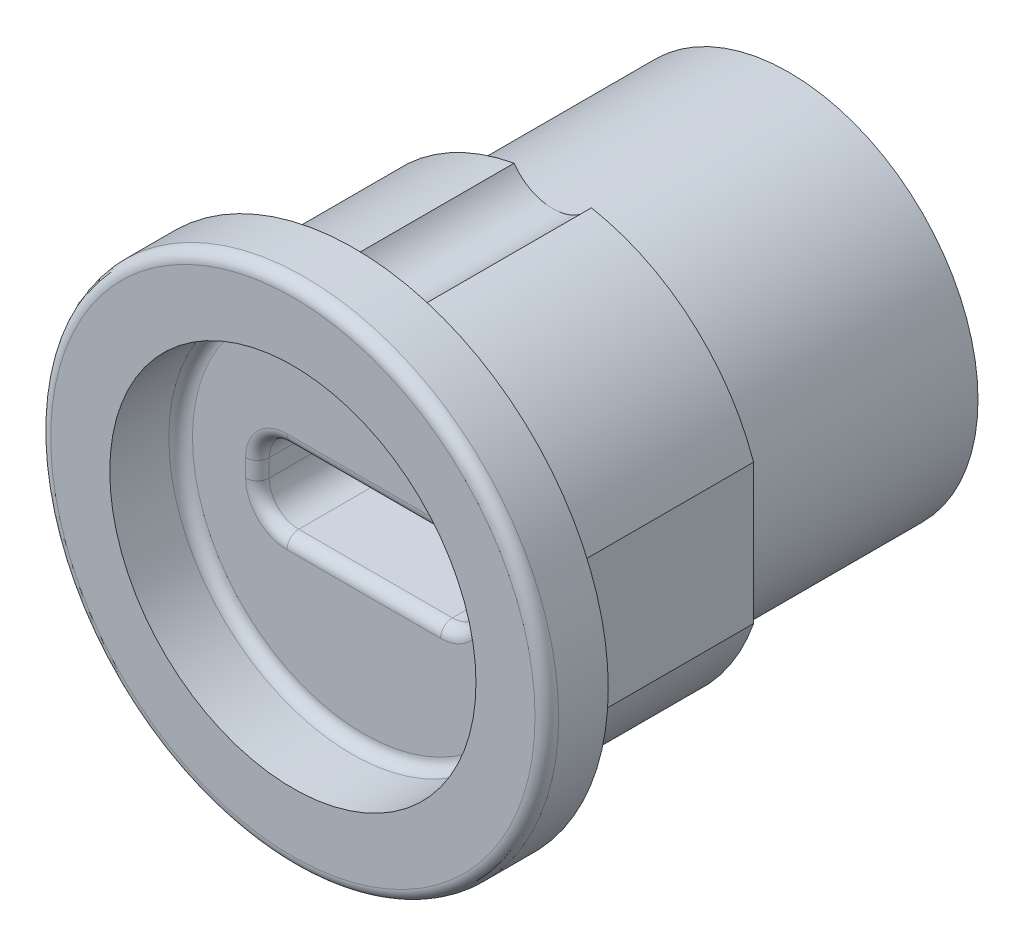
ISO-10303-21;
HEADER;
FILE_DESCRIPTION(('STEP AP214'),'2;1');
FILE_NAME('part.step','',(''),(''),'','','');
FILE_SCHEMA(('AUTOMOTIVE_DESIGN { 1 0 10303 214 1 1 1 1 }'));
ENDSEC;
DATA;
#1=APPLICATION_CONTEXT('core data for automotive mechanical design processes');
#2=APPLICATION_PROTOCOL_DEFINITION('international standard','automotive_design',2000,#1);
#3=PRODUCT_CONTEXT('',#1,'mechanical');
#4=PRODUCT('Part','Part','',(#3));
#5=PRODUCT_RELATED_PRODUCT_CATEGORY('part','',(#4));
#6=PRODUCT_DEFINITION_FORMATION('','',#4);
#7=PRODUCT_DEFINITION_CONTEXT('part definition',#1,'design');
#8=PRODUCT_DEFINITION('design','',#6,#7);
#9=PRODUCT_DEFINITION_SHAPE('','',#8);
#10=(LENGTH_UNIT() NAMED_UNIT(*) SI_UNIT(.MILLI.,.METRE.));
#11=(NAMED_UNIT(*) PLANE_ANGLE_UNIT() SI_UNIT($,.RADIAN.));
#12=(NAMED_UNIT(*) SI_UNIT($,.STERADIAN.) SOLID_ANGLE_UNIT());
#13=UNCERTAINTY_MEASURE_WITH_UNIT(LENGTH_MEASURE(1.E-05),#10,'distance_accuracy_value','');
#14=(GEOMETRIC_REPRESENTATION_CONTEXT(3) GLOBAL_UNCERTAINTY_ASSIGNED_CONTEXT((#13)) GLOBAL_UNIT_ASSIGNED_CONTEXT((#10,
#11,#12)) REPRESENTATION_CONTEXT('',''));
#15=CARTESIAN_POINT('',(0.,0.,0.));
#16=DIRECTION('',(0.,0.,1.));
#17=DIRECTION('',(1.,0.,0.));
#18=AXIS2_PLACEMENT_3D('',#15,#16,#17);
#19=CARTESIAN_POINT('',(0.,0.,-18.4));
#20=DIRECTION('',(0.,0.,1.));
#21=DIRECTION('',(1.,0.,0.));
#22=AXIS2_PLACEMENT_3D('',#19,#20,#21);
#23=CYLINDRICAL_SURFACE('',#22,9.);
#24=DIRECTION('',(0.,0.,-1.));
#25=VECTOR('',#24,1.);
#26=CARTESIAN_POINT('',(-1.63630681719536,8.85,5.93717104351895));
#27=LINE('',#26,#25);
#28=CARTESIAN_POINT('',(-1.63630681719536,8.85,0.));
#29=VERTEX_POINT('',#28);
#30=CARTESIAN_POINT('',(-1.63630681719536,8.85,-8.4));
#31=VERTEX_POINT('',#30);
#32=EDGE_CURVE('E225',#29,#31,#27,.T.);
#33=ORIENTED_EDGE('',*,*,#32,.T.);
#34=CARTESIAN_POINT('',(0.,0.,-8.4));
#35=DIRECTION('',(0.,0.,-1.));
#36=DIRECTION('',(-1.,0.,0.));
#37=AXIS2_PLACEMENT_3D('',#34,#35,#36);
#38=CIRCLE('',#37,9.);
#39=CARTESIAN_POINT('',(-8.5,2.9580398915498,-8.4));
#40=VERTEX_POINT('',#39);
#41=EDGE_CURVE('E256',#40,#31,#38,.T.);
#42=ORIENTED_EDGE('',*,*,#41,.F.);
#43=DIRECTION('',(0.,0.,-1.));
#44=VECTOR('',#43,1.);
#45=CARTESIAN_POINT('',(-8.5,2.9580398915498,5.93717104351895));
#46=LINE('',#45,#44);
#47=CARTESIAN_POINT('',(-8.5,2.9580398915498,0.));
#48=VERTEX_POINT('',#47);
#49=EDGE_CURVE('E234',#48,#40,#46,.T.);
#50=ORIENTED_EDGE('',*,*,#49,.F.);
#51=CARTESIAN_POINT('',(0.,0.,0.));
#52=DIRECTION('',(0.,0.,1.));
#53=DIRECTION('',(1.,0.,0.));
#54=AXIS2_PLACEMENT_3D('',#51,#52,#53);
#55=CIRCLE('',#54,9.);
#56=EDGE_CURVE('E271',#29,#48,#55,.T.);
#57=ORIENTED_EDGE('',*,*,#56,.F.);
#58=EDGE_LOOP('',(#33,#42,#50,#57));
#59=FACE_BOUND('',#58,.T.);
#60=ADVANCED_FACE('F33',(#59),#23,.T.);
#61=DIRECTION('',(0.,0.,-1.));
#62=VECTOR('',#61,1.);
#63=CARTESIAN_POINT('',(8.5,-2.9580398915498,5.93717104351895));
#64=LINE('',#63,#62);
#65=CARTESIAN_POINT('',(8.5,-2.95803989154981,0.));
#66=VERTEX_POINT('',#65);
#67=CARTESIAN_POINT('',(8.5,-2.9580398915498,-8.4));
#68=VERTEX_POINT('',#67);
#69=EDGE_CURVE('E240',#66,#68,#64,.T.);
#70=ORIENTED_EDGE('',*,*,#69,.F.);
#71=CARTESIAN_POINT('',(-8.5,-2.9580398915498,0.));
#72=VERTEX_POINT('',#71);
#73=EDGE_CURVE('E266',#72,#66,#55,.T.);
#74=ORIENTED_EDGE('',*,*,#73,.F.);
#75=DIRECTION('',(0.,0.,-1.));
#76=VECTOR('',#75,1.);
#77=CARTESIAN_POINT('',(-8.5,-2.9580398915498,5.93717104351895));
#78=LINE('',#77,#76);
#79=CARTESIAN_POINT('',(-8.5,-2.9580398915498,-8.4));
#80=VERTEX_POINT('',#79);
#81=EDGE_CURVE('E246',#72,#80,#78,.T.);
#82=ORIENTED_EDGE('',*,*,#81,.T.);
#83=EDGE_CURVE('E253',#68,#80,#38,.T.);
#84=ORIENTED_EDGE('',*,*,#83,.F.);
#85=EDGE_LOOP('',(#70,#74,#82,#84));
#86=FACE_BOUND('',#85,.T.);
#87=ADVANCED_FACE('F392',(#86),#23,.T.);
#88=DIRECTION('',(0.,0.,-1.));
#89=VECTOR('',#88,1.);
#90=CARTESIAN_POINT('',(1.63630681719536,8.85,5.93717104351895));
#91=LINE('',#90,#89);
#92=CARTESIAN_POINT('',(1.63630681719536,8.85,0.));
#93=VERTEX_POINT('',#92);
#94=CARTESIAN_POINT('',(1.63630681719536,8.85,-8.4));
#95=VERTEX_POINT('',#94);
#96=EDGE_CURVE('E228',#93,#95,#91,.T.);
#97=ORIENTED_EDGE('',*,*,#96,.F.);
#98=CARTESIAN_POINT('',(8.5,2.9580398915498,0.));
#99=VERTEX_POINT('',#98);
#100=EDGE_CURVE('E267',#99,#93,#55,.T.);
#101=ORIENTED_EDGE('',*,*,#100,.F.);
#102=DIRECTION('',(0.,0.,-1.));
#103=VECTOR('',#102,1.);
#104=CARTESIAN_POINT('',(8.5,2.9580398915498,5.93717104351895));
#105=LINE('',#104,#103);
#106=CARTESIAN_POINT('',(8.5,2.9580398915498,-8.4));
#107=VERTEX_POINT('',#106);
#108=EDGE_CURVE('E237',#99,#107,#105,.T.);
#109=ORIENTED_EDGE('',*,*,#108,.T.);
#110=EDGE_CURVE('E260',#95,#107,#38,.T.);
#111=ORIENTED_EDGE('',*,*,#110,.F.);
#112=EDGE_LOOP('',(#97,#101,#109,#111));
#113=FACE_BOUND('',#112,.T.);
#114=ADVANCED_FACE('F395',(#113),#23,.T.);
#115=CARTESIAN_POINT('',(0.,0.,2.6));
#116=DIRECTION('',(0.,0.,-1.));
#117=DIRECTION('',(-1.,0.,0.));
#118=AXIS2_PLACEMENT_3D('',#115,#116,#117);
#119=CYLINDRICAL_SURFACE('',#118,10.75);
#120=CARTESIAN_POINT('',(0.,0.,2.1));
#121=DIRECTION('',(0.,0.,1.));
#122=DIRECTION('',(1.,0.,0.));
#123=AXIS2_PLACEMENT_3D('',#120,#121,#122);
#124=CIRCLE('',#123,10.75);
#125=CARTESIAN_POINT('',(10.75,0.,2.1));
#126=VERTEX_POINT('',#125);
#127=EDGE_CURVE('E308',#126,#126,#124,.F.);
#128=ORIENTED_EDGE('',*,*,#127,.T.);
#129=EDGE_LOOP('',(#128));
#130=FACE_BOUND('',#129,.T.);
#131=CARTESIAN_POINT('',(0.,0.,0.));
#132=DIRECTION('',(0.,0.,1.));
#133=DIRECTION('',(1.,0.,0.));
#134=AXIS2_PLACEMENT_3D('',#131,#132,#133);
#135=CIRCLE('',#134,10.75);
#136=CARTESIAN_POINT('',(10.75,0.,0.));
#137=VERTEX_POINT('',#136);
#138=EDGE_CURVE('E263',#137,#137,#135,.T.);
#139=ORIENTED_EDGE('',*,*,#138,.T.);
#140=EDGE_LOOP('',(#139));
#141=FACE_BOUND('',#140,.T.);
#142=ADVANCED_FACE('F403',(#130,#141),#119,.T.);
#143=CARTESIAN_POINT('',(0.,0.,2.6));
#144=DIRECTION('',(0.,0.,1.));
#145=DIRECTION('',(1.,0.,0.));
#146=AXIS2_PLACEMENT_3D('',#143,#144,#145);
#147=PLANE('',#146);
#148=CARTESIAN_POINT('',(0.,0.,2.6));
#149=DIRECTION('',(0.,0.,1.));
#150=DIRECTION('',(1.,0.,0.));
#151=AXIS2_PLACEMENT_3D('',#148,#149,#150);
#152=CIRCLE('',#151,10.25);
#153=CARTESIAN_POINT('',(10.25,0.,2.6));
#154=VERTEX_POINT('',#153);
#155=EDGE_CURVE('E305',#154,#154,#152,.T.);
#156=ORIENTED_EDGE('',*,*,#155,.T.);
#157=EDGE_LOOP('',(#156));
#158=FACE_BOUND('',#157,.T.);
#159=CARTESIAN_POINT('',(0.,0.,2.6));
#160=DIRECTION('',(0.,0.,1.));
#161=DIRECTION('',(1.,0.,0.));
#162=AXIS2_PLACEMENT_3D('',#159,#160,#161);
#163=CIRCLE('',#162,7.75);
#164=CARTESIAN_POINT('',(7.75,0.,2.6));
#165=VERTEX_POINT('',#164);
#166=EDGE_CURVE('E259',#165,#165,#163,.T.);
#167=ORIENTED_EDGE('',*,*,#166,.F.);
#168=EDGE_LOOP('',(#167));
#169=FACE_BOUND('',#168,.T.);
#170=ADVANCED_FACE('F408',(#158,#169),#147,.T.);
#171=CARTESIAN_POINT('',(0.,0.,0.));
#172=DIRECTION('',(0.,0.,1.));
#173=DIRECTION('',(1.,0.,0.));
#174=AXIS2_PLACEMENT_3D('',#171,#172,#173);
#175=PLANE('',#174);
#176=ORIENTED_EDGE('',*,*,#100,.T.);
#177=CARTESIAN_POINT('',(0.,10.,0.));
#178=DIRECTION('',(0.,0.,1.));
#179=DIRECTION('',(1.,0.,0.));
#180=AXIS2_PLACEMENT_3D('',#177,#178,#179);
#181=CIRCLE('',#180,2.);
#182=EDGE_CURVE('E221',#93,#29,#181,.F.);
#183=ORIENTED_EDGE('',*,*,#182,.T.);
#184=ORIENTED_EDGE('',*,*,#56,.T.);
#185=DIRECTION('',(0.,-1.,0.));
#186=VECTOR('',#185,1.);
#187=CARTESIAN_POINT('',(-8.5,2.9580398915498,0.));
#188=LINE('',#187,#186);
#189=EDGE_CURVE('E243',#48,#72,#188,.T.);
#190=ORIENTED_EDGE('',*,*,#189,.T.);
#191=ORIENTED_EDGE('',*,*,#73,.T.);
#192=DIRECTION('',(0.,1.,0.));
#193=VECTOR('',#192,1.);
#194=CARTESIAN_POINT('',(8.5,2.9580398915498,0.));
#195=LINE('',#194,#193);
#196=EDGE_CURVE('E233',#66,#99,#195,.T.);
#197=ORIENTED_EDGE('',*,*,#196,.T.);
#198=EDGE_LOOP('',(#176,#183,#184,#190,#191,#197));
#199=FACE_BOUND('',#198,.T.);
#200=ORIENTED_EDGE('',*,*,#138,.F.);
#201=EDGE_LOOP('',(#200));
#202=FACE_BOUND('',#201,.T.);
#203=ADVANCED_FACE('F418',(#199,#202),#175,.F.);
#204=CARTESIAN_POINT('',(0.,0.,-0.4));
#205=DIRECTION('',(0.,0.,1.));
#206=DIRECTION('',(1.,0.,0.));
#207=AXIS2_PLACEMENT_3D('',#204,#205,#206);
#208=CYLINDRICAL_SURFACE('',#207,7.75);
#209=CARTESIAN_POINT('',(0.,0.,0.0999999999999998));
#210=DIRECTION('',(0.,0.,1.));
#211=DIRECTION('',(1.,0.,0.));
#212=AXIS2_PLACEMENT_3D('',#209,#210,#211);
#213=CIRCLE('',#212,7.75);
#214=CARTESIAN_POINT('',(7.75,0.,0.0999999999999998));
#215=VERTEX_POINT('',#214);
#216=EDGE_CURVE('E42',#215,#215,#213,.F.);
#217=ORIENTED_EDGE('',*,*,#216,.T.);
#218=EDGE_LOOP('',(#217));
#219=FACE_BOUND('',#218,.T.);
#220=ORIENTED_EDGE('',*,*,#166,.T.);
#221=EDGE_LOOP('',(#220));
#222=FACE_BOUND('',#221,.T.);
#223=ADVANCED_FACE('F453',(#219,#222),#208,.F.);
#224=CARTESIAN_POINT('',(0.,0.,-0.4));
#225=DIRECTION('',(0.,0.,1.));
#226=DIRECTION('',(1.,0.,0.));
#227=AXIS2_PLACEMENT_3D('',#224,#225,#226);
#228=PLANE('',#227);
#229=CARTESIAN_POINT('',(0.,0.,-0.4));
#230=DIRECTION('',(0.,0.,1.));
#231=DIRECTION('',(1.,0.,0.));
#232=AXIS2_PLACEMENT_3D('',#229,#230,#231);
#233=CIRCLE('',#232,7.25);
#234=CARTESIAN_POINT('',(7.25,0.,-0.4));
#235=VERTEX_POINT('',#234);
#236=EDGE_CURVE('E291',#235,#235,#233,.T.);
#237=ORIENTED_EDGE('',*,*,#236,.T.);
#238=EDGE_LOOP('',(#237));
#239=FACE_BOUND('',#238,.T.);
#240=DIRECTION('',(-1.,0.,0.));
#241=VECTOR('',#240,1.);
#242=CARTESIAN_POINT('',(3.25,2.125,-0.4));
#243=LINE('',#242,#241);
#244=CARTESIAN_POINT('',(-3.25,2.125,-0.4));
#245=VERTEX_POINT('',#244);
#246=CARTESIAN_POINT('',(3.25,2.125,-0.4));
#247=VERTEX_POINT('',#246);
#248=EDGE_CURVE('E274',#245,#247,#243,.F.);
#249=ORIENTED_EDGE('',*,*,#248,.T.);
#250=CARTESIAN_POINT('',(3.25,0.375,-0.4));
#251=DIRECTION('',(0.,0.,1.));
#252=DIRECTION('',(1.,0.,0.));
#253=AXIS2_PLACEMENT_3D('',#250,#251,#252);
#254=CIRCLE('',#253,1.75);
#255=CARTESIAN_POINT('',(5.,0.375,-0.4));
#256=VERTEX_POINT('',#255);
#257=EDGE_CURVE('E288',#247,#256,#254,.F.);
#258=ORIENTED_EDGE('',*,*,#257,.T.);
#259=DIRECTION('',(0.,1.,0.));
#260=VECTOR('',#259,1.);
#261=CARTESIAN_POINT('',(5.,-0.375,-0.4));
#262=LINE('',#261,#260);
#263=CARTESIAN_POINT('',(5.,-0.375,-0.4));
#264=VERTEX_POINT('',#263);
#265=EDGE_CURVE('E286',#256,#264,#262,.F.);
#266=ORIENTED_EDGE('',*,*,#265,.T.);
#267=CARTESIAN_POINT('',(3.25,-0.375,-0.4));
#268=DIRECTION('',(0.,0.,1.));
#269=DIRECTION('',(1.,0.,0.));
#270=AXIS2_PLACEMENT_3D('',#267,#268,#269);
#271=CIRCLE('',#270,1.75);
#272=CARTESIAN_POINT('',(3.25,-2.125,-0.4));
#273=VERTEX_POINT('',#272);
#274=EDGE_CURVE('E284',#264,#273,#271,.F.);
#275=ORIENTED_EDGE('',*,*,#274,.T.);
#276=DIRECTION('',(1.,0.,0.));
#277=VECTOR('',#276,1.);
#278=CARTESIAN_POINT('',(-3.25,-2.125,-0.4));
#279=LINE('',#278,#277);
#280=CARTESIAN_POINT('',(-3.25,-2.125,-0.4));
#281=VERTEX_POINT('',#280);
#282=EDGE_CURVE('E282',#273,#281,#279,.F.);
#283=ORIENTED_EDGE('',*,*,#282,.T.);
#284=CARTESIAN_POINT('',(-3.25,-0.375,-0.4));
#285=DIRECTION('',(0.,0.,1.));
#286=DIRECTION('',(1.,0.,0.));
#287=AXIS2_PLACEMENT_3D('',#284,#285,#286);
#288=CIRCLE('',#287,1.75);
#289=CARTESIAN_POINT('',(-5.,-0.375,-0.4));
#290=VERTEX_POINT('',#289);
#291=EDGE_CURVE('E280',#281,#290,#288,.F.);
#292=ORIENTED_EDGE('',*,*,#291,.T.);
#293=DIRECTION('',(0.,-1.,0.));
#294=VECTOR('',#293,1.);
#295=CARTESIAN_POINT('',(-5.,0.375,-0.4));
#296=LINE('',#295,#294);
#297=CARTESIAN_POINT('',(-5.,0.375,-0.4));
#298=VERTEX_POINT('',#297);
#299=EDGE_CURVE('E278',#290,#298,#296,.F.);
#300=ORIENTED_EDGE('',*,*,#299,.T.);
#301=CARTESIAN_POINT('',(-3.25,0.375,-0.4));
#302=DIRECTION('',(0.,0.,1.));
#303=DIRECTION('',(1.,0.,0.));
#304=AXIS2_PLACEMENT_3D('',#301,#302,#303);
#305=CIRCLE('',#304,1.75);
#306=EDGE_CURVE('E276',#298,#245,#305,.F.);
#307=ORIENTED_EDGE('',*,*,#306,.T.);
#308=EDGE_LOOP('',(#249,#258,#266,#275,#283,#292,#300,#307));
#309=FACE_BOUND('',#308,.T.);
#310=ADVANCED_FACE('F371',(#239,#309),#228,.T.);
#311=CARTESIAN_POINT('',(0.,0.,-8.4));
#312=DIRECTION('',(0.,0.,-1.));
#313=DIRECTION('',(-1.,0.,0.));
#314=AXIS2_PLACEMENT_3D('',#311,#312,#313);
#315=PLANE('',#314);
#316=CARTESIAN_POINT('',(0.,10.,-8.4));
#317=DIRECTION('',(0.,0.,-1.));
#318=DIRECTION('',(-1.,0.,0.));
#319=AXIS2_PLACEMENT_3D('',#316,#317,#318);
#320=CIRCLE('',#319,2.);
#321=CARTESIAN_POINT('',(0.,8.,-8.4));
#322=VERTEX_POINT('',#321);
#323=EDGE_CURVE('E219',#95,#322,#320,.T.);
#324=ORIENTED_EDGE('',*,*,#323,.F.);
#325=ORIENTED_EDGE('',*,*,#110,.T.);
#326=DIRECTION('',(0.,1.,0.));
#327=VECTOR('',#326,1.);
#328=CARTESIAN_POINT('',(8.5,2.9580398915498,-8.4));
#329=LINE('',#328,#327);
#330=EDGE_CURVE('E231',#68,#107,#329,.T.);
#331=ORIENTED_EDGE('',*,*,#330,.F.);
#332=ORIENTED_EDGE('',*,*,#83,.T.);
#333=DIRECTION('',(0.,-1.,0.));
#334=VECTOR('',#333,1.);
#335=CARTESIAN_POINT('',(-8.5,2.9580398915498,-8.4));
#336=LINE('',#335,#334);
#337=EDGE_CURVE('E203',#40,#80,#336,.T.);
#338=ORIENTED_EDGE('',*,*,#337,.F.);
#339=ORIENTED_EDGE('',*,*,#41,.T.);
#340=EDGE_CURVE('E222',#322,#31,#320,.T.);
#341=ORIENTED_EDGE('',*,*,#340,.F.);
#342=CARTESIAN_POINT('',(0.,0.,-8.4));
#343=DIRECTION('',(0.,0.,-1.));
#344=DIRECTION('',(-1.,0.,0.));
#345=AXIS2_PLACEMENT_3D('',#342,#343,#344);
#346=CIRCLE('',#345,8.);
#347=EDGE_CURVE('E250',#322,#322,#346,.T.);
#348=ORIENTED_EDGE('',*,*,#347,.F.);
#349=EDGE_LOOP('',(#324,#325,#331,#332,#338,#339,#341,#348));
#350=FACE_BOUND('',#349,.T.);
#351=ADVANCED_FACE('F432',(#350),#315,.T.);
#352=CARTESIAN_POINT('',(0.,0.,-8.4));
#353=DIRECTION('',(0.,0.,-1.));
#354=DIRECTION('',(-1.,0.,0.));
#355=AXIS2_PLACEMENT_3D('',#352,#353,#354);
#356=CYLINDRICAL_SURFACE('',#355,8.);
#357=ORIENTED_EDGE('',*,*,#347,.T.);
#358=EDGE_LOOP('',(#357));
#359=FACE_BOUND('',#358,.T.);
#360=CARTESIAN_POINT('',(0.,0.,-18.4));
#361=DIRECTION('',(0.,0.,-1.));
#362=DIRECTION('',(-1.,0.,0.));
#363=AXIS2_PLACEMENT_3D('',#360,#361,#362);
#364=CIRCLE('',#363,8.);
#365=CARTESIAN_POINT('',(-8.,0.,-18.4));
#366=VERTEX_POINT('',#365);
#367=EDGE_CURVE('E230',#366,#366,#364,.T.);
#368=ORIENTED_EDGE('',*,*,#367,.F.);
#369=EDGE_LOOP('',(#368));
#370=FACE_BOUND('',#369,.T.);
#371=ADVANCED_FACE('F438',(#359,#370),#356,.T.);
#372=CARTESIAN_POINT('',(0.,0.,-18.4));
#373=DIRECTION('',(0.,0.,1.));
#374=DIRECTION('',(1.,0.,0.));
#375=AXIS2_PLACEMENT_3D('',#372,#373,#374);
#376=PLANE('',#375);
#377=DIRECTION('',(-1.,0.,0.));
#378=VECTOR('',#377,1.);
#379=CARTESIAN_POINT('',(-3.25,1.625,-18.4));
#380=LINE('',#379,#378);
#381=CARTESIAN_POINT('',(3.25,1.625,-18.4));
#382=VERTEX_POINT('',#381);
#383=CARTESIAN_POINT('',(-3.25,1.625,-18.4));
#384=VERTEX_POINT('',#383);
#385=EDGE_CURVE('E169',#382,#384,#380,.T.);
#386=ORIENTED_EDGE('',*,*,#385,.T.);
#387=CARTESIAN_POINT('',(-3.25,0.375,-18.4));
#388=DIRECTION('',(0.,0.,1.));
#389=DIRECTION('',(1.,0.,0.));
#390=AXIS2_PLACEMENT_3D('',#387,#388,#389);
#391=CIRCLE('',#390,1.25);
#392=CARTESIAN_POINT('',(-4.5,0.375,-18.4));
#393=VERTEX_POINT('',#392);
#394=EDGE_CURVE('E164',#384,#393,#391,.T.);
#395=ORIENTED_EDGE('',*,*,#394,.T.);
#396=DIRECTION('',(0.,-1.,0.));
#397=VECTOR('',#396,1.);
#398=CARTESIAN_POINT('',(-4.5,-0.375,-18.4));
#399=LINE('',#398,#397);
#400=CARTESIAN_POINT('',(-4.5,-0.375,-18.4));
#401=VERTEX_POINT('',#400);
#402=EDGE_CURVE('E173',#393,#401,#399,.T.);
#403=ORIENTED_EDGE('',*,*,#402,.T.);
#404=CARTESIAN_POINT('',(-3.25,-0.375,-18.4));
#405=DIRECTION('',(0.,0.,1.));
#406=DIRECTION('',(1.,0.,0.));
#407=AXIS2_PLACEMENT_3D('',#404,#405,#406);
#408=CIRCLE('',#407,1.25);
#409=CARTESIAN_POINT('',(-3.25,-1.625,-18.4));
#410=VERTEX_POINT('',#409);
#411=EDGE_CURVE('E178',#401,#410,#408,.T.);
#412=ORIENTED_EDGE('',*,*,#411,.T.);
#413=DIRECTION('',(1.,0.,0.));
#414=VECTOR('',#413,1.);
#415=CARTESIAN_POINT('',(-3.25,-1.625,-18.4));
#416=LINE('',#415,#414);
#417=CARTESIAN_POINT('',(3.25,-1.625,-18.4));
#418=VERTEX_POINT('',#417);
#419=EDGE_CURVE('E189',#410,#418,#416,.T.);
#420=ORIENTED_EDGE('',*,*,#419,.T.);
#421=CARTESIAN_POINT('',(3.25,-0.375,-18.4));
#422=DIRECTION('',(0.,0.,1.));
#423=DIRECTION('',(1.,0.,0.));
#424=AXIS2_PLACEMENT_3D('',#421,#422,#423);
#425=CIRCLE('',#424,1.25);
#426=CARTESIAN_POINT('',(4.5,-0.375,-18.4));
#427=VERTEX_POINT('',#426);
#428=EDGE_CURVE('E192',#418,#427,#425,.T.);
#429=ORIENTED_EDGE('',*,*,#428,.T.);
#430=DIRECTION('',(0.,1.,0.));
#431=VECTOR('',#430,1.);
#432=CARTESIAN_POINT('',(4.5,-0.375,-18.4));
#433=LINE('',#432,#431);
#434=CARTESIAN_POINT('',(4.5,0.375,-18.4));
#435=VERTEX_POINT('',#434);
#436=EDGE_CURVE('E195',#427,#435,#433,.T.);
#437=ORIENTED_EDGE('',*,*,#436,.T.);
#438=CARTESIAN_POINT('',(3.25,0.375,-18.4));
#439=DIRECTION('',(0.,0.,1.));
#440=DIRECTION('',(1.,0.,0.));
#441=AXIS2_PLACEMENT_3D('',#438,#439,#440);
#442=CIRCLE('',#441,1.25);
#443=EDGE_CURVE('E198',#435,#382,#442,.T.);
#444=ORIENTED_EDGE('',*,*,#443,.T.);
#445=EDGE_LOOP('',(#386,#395,#403,#412,#420,#429,#437,#444));
#446=FACE_BOUND('',#445,.T.);
#447=ORIENTED_EDGE('',*,*,#367,.T.);
#448=EDGE_LOOP('',(#447));
#449=FACE_BOUND('',#448,.T.);
#450=ADVANCED_FACE('F180',(#446,#449),#376,.F.);
#451=CARTESIAN_POINT('',(-8.5,2.9580398915498,5.93717104351895));
#452=DIRECTION('',(1.,0.,0.));
#453=DIRECTION('',(0.,0.,-1.));
#454=AXIS2_PLACEMENT_3D('',#451,#452,#453);
#455=PLANE('',#454);
#456=ORIENTED_EDGE('',*,*,#49,.T.);
#457=ORIENTED_EDGE('',*,*,#337,.T.);
#458=ORIENTED_EDGE('',*,*,#81,.F.);
#459=ORIENTED_EDGE('',*,*,#189,.F.);
#460=EDGE_LOOP('',(#456,#457,#458,#459));
#461=FACE_BOUND('',#460,.T.);
#462=ADVANCED_FACE('F444',(#461),#455,.F.);
#463=CARTESIAN_POINT('',(8.5,2.9580398915498,5.93717104351895));
#464=DIRECTION('',(-1.,0.,0.));
#465=DIRECTION('',(0.,0.,1.));
#466=AXIS2_PLACEMENT_3D('',#463,#464,#465);
#467=PLANE('',#466);
#468=ORIENTED_EDGE('',*,*,#69,.T.);
#469=ORIENTED_EDGE('',*,*,#330,.T.);
#470=ORIENTED_EDGE('',*,*,#108,.F.);
#471=ORIENTED_EDGE('',*,*,#196,.F.);
#472=EDGE_LOOP('',(#468,#469,#470,#471));
#473=FACE_BOUND('',#472,.T.);
#474=ADVANCED_FACE('F426',(#473),#467,.F.);
#475=CARTESIAN_POINT('',(0.,10.,5.93717104351895));
#476=DIRECTION('',(0.,0.,-1.));
#477=DIRECTION('',(-1.,0.,0.));
#478=AXIS2_PLACEMENT_3D('',#475,#476,#477);
#479=CYLINDRICAL_SURFACE('',#478,2.);
#480=ORIENTED_EDGE('',*,*,#96,.T.);
#481=ORIENTED_EDGE('',*,*,#323,.T.);
#482=ORIENTED_EDGE('',*,*,#340,.T.);
#483=ORIENTED_EDGE('',*,*,#32,.F.);
#484=ORIENTED_EDGE('',*,*,#182,.F.);
#485=EDGE_LOOP('',(#480,#481,#482,#483,#484));
#486=FACE_BOUND('',#485,.T.);
#487=ADVANCED_FACE('F435',(#486),#479,.F.);
#488=CARTESIAN_POINT('',(-3.25,0.375,-18.4));
#489=DIRECTION('',(0.,0.,1.));
#490=DIRECTION('',(1.,0.,0.));
#491=AXIS2_PLACEMENT_3D('',#488,#489,#490);
#492=CYLINDRICAL_SURFACE('',#491,1.25);
#493=DIRECTION('',(0.,0.,1.));
#494=VECTOR('',#493,1.);
#495=CARTESIAN_POINT('',(-3.25,1.625,-18.4));
#496=LINE('',#495,#494);
#497=CARTESIAN_POINT('',(-3.25,1.625,-0.900000000000001));
#498=VERTEX_POINT('',#497);
#499=EDGE_CURVE('E201',#384,#498,#496,.T.);
#500=ORIENTED_EDGE('',*,*,#499,.T.);
#501=CARTESIAN_POINT('',(-3.25,0.375,-0.900000000000001));
#502=DIRECTION('',(0.,0.,1.));
#503=DIRECTION('',(1.,0.,0.));
#504=AXIS2_PLACEMENT_3D('',#501,#502,#503);
#505=CIRCLE('',#504,1.25);
#506=CARTESIAN_POINT('',(-4.5,0.375,-0.900000000000001));
#507=VERTEX_POINT('',#506);
#508=EDGE_CURVE('E55',#498,#507,#505,.T.);
#509=ORIENTED_EDGE('',*,*,#508,.T.);
#510=DIRECTION('',(0.,0.,1.));
#511=VECTOR('',#510,1.);
#512=CARTESIAN_POINT('',(-4.5,0.375,-18.4));
#513=LINE('',#512,#511);
#514=EDGE_CURVE('E160',#393,#507,#513,.T.);
#515=ORIENTED_EDGE('',*,*,#514,.F.);
#516=ORIENTED_EDGE('',*,*,#394,.F.);
#517=EDGE_LOOP('',(#500,#509,#515,#516));
#518=FACE_BOUND('',#517,.T.);
#519=ADVANCED_FACE('F162',(#518),#492,.F.);
#520=CARTESIAN_POINT('',(-3.25,1.625,-18.4));
#521=DIRECTION('',(0.,1.,0.));
#522=DIRECTION('',(0.,0.,1.));
#523=AXIS2_PLACEMENT_3D('',#520,#521,#522);
#524=PLANE('',#523);
#525=DIRECTION('',(0.,0.,1.));
#526=VECTOR('',#525,1.);
#527=CARTESIAN_POINT('',(3.25,1.625,-18.4));
#528=LINE('',#527,#526);
#529=CARTESIAN_POINT('',(3.25,1.625,-0.900000000000001));
#530=VERTEX_POINT('',#529);
#531=EDGE_CURVE('E204',#382,#530,#528,.T.);
#532=ORIENTED_EDGE('',*,*,#531,.T.);
#533=DIRECTION('',(-1.,0.,0.));
#534=VECTOR('',#533,1.);
#535=CARTESIAN_POINT('',(-3.25,1.625,-0.900000000000001));
#536=LINE('',#535,#534);
#537=EDGE_CURVE('E11',#530,#498,#536,.T.);
#538=ORIENTED_EDGE('',*,*,#537,.T.);
#539=ORIENTED_EDGE('',*,*,#499,.F.);
#540=ORIENTED_EDGE('',*,*,#385,.F.);
#541=EDGE_LOOP('',(#532,#538,#539,#540));
#542=FACE_BOUND('',#541,.T.);
#543=ADVANCED_FACE('F360',(#542),#524,.F.);
#544=CARTESIAN_POINT('',(3.25,0.375,-18.4));
#545=DIRECTION('',(0.,0.,1.));
#546=DIRECTION('',(1.,0.,0.));
#547=AXIS2_PLACEMENT_3D('',#544,#545,#546);
#548=CYLINDRICAL_SURFACE('',#547,1.25);
#549=DIRECTION('',(0.,0.,1.));
#550=VECTOR('',#549,1.);
#551=CARTESIAN_POINT('',(4.5,0.375,-18.4));
#552=LINE('',#551,#550);
#553=CARTESIAN_POINT('',(4.5,0.375,-0.900000000000001));
#554=VERTEX_POINT('',#553);
#555=EDGE_CURVE('E206',#435,#554,#552,.T.);
#556=ORIENTED_EDGE('',*,*,#555,.T.);
#557=CARTESIAN_POINT('',(3.25,0.375,-0.900000000000001));
#558=DIRECTION('',(0.,0.,1.));
#559=DIRECTION('',(1.,0.,0.));
#560=AXIS2_PLACEMENT_3D('',#557,#558,#559);
#561=CIRCLE('',#560,1.25);
#562=EDGE_CURVE('E270',#554,#530,#561,.T.);
#563=ORIENTED_EDGE('',*,*,#562,.T.);
#564=ORIENTED_EDGE('',*,*,#531,.F.);
#565=ORIENTED_EDGE('',*,*,#443,.F.);
#566=EDGE_LOOP('',(#556,#563,#564,#565));
#567=FACE_BOUND('',#566,.T.);
#568=ADVANCED_FACE('F358',(#567),#548,.F.);
#569=CARTESIAN_POINT('',(4.5,-0.375,-18.4));
#570=DIRECTION('',(1.,0.,0.));
#571=DIRECTION('',(0.,0.,-1.));
#572=AXIS2_PLACEMENT_3D('',#569,#570,#571);
#573=PLANE('',#572);
#574=DIRECTION('',(0.,0.,1.));
#575=VECTOR('',#574,1.);
#576=CARTESIAN_POINT('',(4.5,-0.375,-18.4));
#577=LINE('',#576,#575);
#578=CARTESIAN_POINT('',(4.5,-0.375,-0.900000000000001));
#579=VERTEX_POINT('',#578);
#580=EDGE_CURVE('E209',#427,#579,#577,.T.);
#581=ORIENTED_EDGE('',*,*,#580,.T.);
#582=DIRECTION('',(0.,1.,0.));
#583=VECTOR('',#582,1.);
#584=CARTESIAN_POINT('',(4.5,0.375,-0.900000000000001));
#585=LINE('',#584,#583);
#586=EDGE_CURVE('E294',#579,#554,#585,.T.);
#587=ORIENTED_EDGE('',*,*,#586,.T.);
#588=ORIENTED_EDGE('',*,*,#555,.F.);
#589=ORIENTED_EDGE('',*,*,#436,.F.);
#590=EDGE_LOOP('',(#581,#587,#588,#589));
#591=FACE_BOUND('',#590,.T.);
#592=ADVANCED_FACE('F353',(#591),#573,.F.);
#593=CARTESIAN_POINT('',(3.25,-0.375,-18.4));
#594=DIRECTION('',(0.,0.,1.));
#595=DIRECTION('',(1.,0.,0.));
#596=AXIS2_PLACEMENT_3D('',#593,#594,#595);
#597=CYLINDRICAL_SURFACE('',#596,1.25);
#598=DIRECTION('',(0.,0.,1.));
#599=VECTOR('',#598,1.);
#600=CARTESIAN_POINT('',(3.25,-1.625,-18.4));
#601=LINE('',#600,#599);
#602=CARTESIAN_POINT('',(3.25,-1.625,-0.900000000000001));
#603=VERTEX_POINT('',#602);
#604=EDGE_CURVE('E212',#418,#603,#601,.T.);
#605=ORIENTED_EDGE('',*,*,#604,.T.);
#606=CARTESIAN_POINT('',(3.25,-0.375,-0.900000000000001));
#607=DIRECTION('',(0.,0.,1.));
#608=DIRECTION('',(1.,0.,0.));
#609=AXIS2_PLACEMENT_3D('',#606,#607,#608);
#610=CIRCLE('',#609,1.25);
#611=EDGE_CURVE('E296',#603,#579,#610,.T.);
#612=ORIENTED_EDGE('',*,*,#611,.T.);
#613=ORIENTED_EDGE('',*,*,#580,.F.);
#614=ORIENTED_EDGE('',*,*,#428,.F.);
#615=EDGE_LOOP('',(#605,#612,#613,#614));
#616=FACE_BOUND('',#615,.T.);
#617=ADVANCED_FACE('F348',(#616),#597,.F.);
#618=CARTESIAN_POINT('',(-3.25,-1.625,-18.4));
#619=DIRECTION('',(0.,-1.,0.));
#620=DIRECTION('',(1.,0.,0.));
#621=AXIS2_PLACEMENT_3D('',#618,#619,#620);
#622=PLANE('',#621);
#623=DIRECTION('',(0.,0.,1.));
#624=VECTOR('',#623,1.);
#625=CARTESIAN_POINT('',(-3.25,-1.625,-18.4));
#626=LINE('',#625,#624);
#627=CARTESIAN_POINT('',(-3.25,-1.625,-0.900000000000001));
#628=VERTEX_POINT('',#627);
#629=EDGE_CURVE('E215',#410,#628,#626,.T.);
#630=ORIENTED_EDGE('',*,*,#629,.T.);
#631=DIRECTION('',(1.,0.,0.));
#632=VECTOR('',#631,1.);
#633=CARTESIAN_POINT('',(3.25,-1.625,-0.900000000000001));
#634=LINE('',#633,#632);
#635=EDGE_CURVE('E298',#628,#603,#634,.T.);
#636=ORIENTED_EDGE('',*,*,#635,.T.);
#637=ORIENTED_EDGE('',*,*,#604,.F.);
#638=ORIENTED_EDGE('',*,*,#419,.F.);
#639=EDGE_LOOP('',(#630,#636,#637,#638));
#640=FACE_BOUND('',#639,.T.);
#641=ADVANCED_FACE('F344',(#640),#622,.F.);
#642=CARTESIAN_POINT('',(-3.25,-0.375,-18.4));
#643=DIRECTION('',(0.,0.,1.));
#644=DIRECTION('',(1.,0.,0.));
#645=AXIS2_PLACEMENT_3D('',#642,#643,#644);
#646=CYLINDRICAL_SURFACE('',#645,1.25);
#647=DIRECTION('',(0.,0.,1.));
#648=VECTOR('',#647,1.);
#649=CARTESIAN_POINT('',(-4.5,-0.375,-18.4));
#650=LINE('',#649,#648);
#651=CARTESIAN_POINT('',(-4.5,-0.375,-0.900000000000001));
#652=VERTEX_POINT('',#651);
#653=EDGE_CURVE('E168',#401,#652,#650,.T.);
#654=ORIENTED_EDGE('',*,*,#653,.T.);
#655=CARTESIAN_POINT('',(-3.25,-0.375,-0.900000000000001));
#656=DIRECTION('',(0.,0.,1.));
#657=DIRECTION('',(1.,0.,0.));
#658=AXIS2_PLACEMENT_3D('',#655,#656,#657);
#659=CIRCLE('',#658,1.25);
#660=EDGE_CURVE('E300',#652,#628,#659,.T.);
#661=ORIENTED_EDGE('',*,*,#660,.T.);
#662=ORIENTED_EDGE('',*,*,#629,.F.);
#663=ORIENTED_EDGE('',*,*,#411,.F.);
#664=EDGE_LOOP('',(#654,#661,#662,#663));
#665=FACE_BOUND('',#664,.T.);
#666=ADVANCED_FACE('F341',(#665),#646,.F.);
#667=CARTESIAN_POINT('',(-4.5,-0.375,-18.4));
#668=DIRECTION('',(-1.,0.,0.));
#669=DIRECTION('',(0.,0.,1.));
#670=AXIS2_PLACEMENT_3D('',#667,#668,#669);
#671=PLANE('',#670);
#672=ORIENTED_EDGE('',*,*,#514,.T.);
#673=DIRECTION('',(0.,-1.,0.));
#674=VECTOR('',#673,1.);
#675=CARTESIAN_POINT('',(-4.5,-0.375,-0.900000000000001));
#676=LINE('',#675,#674);
#677=EDGE_CURVE('E302',#507,#652,#676,.T.);
#678=ORIENTED_EDGE('',*,*,#677,.T.);
#679=ORIENTED_EDGE('',*,*,#653,.F.);
#680=ORIENTED_EDGE('',*,*,#402,.F.);
#681=EDGE_LOOP('',(#672,#678,#679,#680));
#682=FACE_BOUND('',#681,.T.);
#683=ADVANCED_FACE('F174',(#682),#671,.F.);
#684=CARTESIAN_POINT('',(-3.25,-0.375,-0.900000000000001));
#685=DIRECTION('',(0.,0.,1.));
#686=DIRECTION('',(1.,0.,0.));
#687=AXIS2_PLACEMENT_3D('',#684,#685,#686);
#688=TOROIDAL_SURFACE('',#687,1.75,0.5);
#689=CARTESIAN_POINT('',(-5.,-0.375,-0.9));
#690=DIRECTION('',(0.,1.,0.));
#691=DIRECTION('',(-1.,0.,0.));
#692=AXIS2_PLACEMENT_3D('',#689,#690,#691);
#693=CIRCLE('',#692,0.5);
#694=EDGE_CURVE('E186',#290,#652,#693,.T.);
#695=ORIENTED_EDGE('',*,*,#694,.F.);
#696=ORIENTED_EDGE('',*,*,#291,.F.);
#697=CARTESIAN_POINT('',(-3.25,-2.125,-0.900000000000001));
#698=DIRECTION('',(1.,0.,0.));
#699=DIRECTION('',(0.,0.,-1.));
#700=AXIS2_PLACEMENT_3D('',#697,#698,#699);
#701=CIRCLE('',#700,0.5);
#702=EDGE_CURVE('E37',#628,#281,#701,.T.);
#703=ORIENTED_EDGE('',*,*,#702,.F.);
#704=ORIENTED_EDGE('',*,*,#660,.F.);
#705=EDGE_LOOP('',(#695,#696,#703,#704));
#706=FACE_BOUND('',#705,.T.);
#707=ADVANCED_FACE('F337',(#706),#688,.T.);
#708=CARTESIAN_POINT('',(-3.25,-2.125,-0.900000000000001));
#709=DIRECTION('',(-1.,0.,0.));
#710=DIRECTION('',(0.,-1.,0.));
#711=AXIS2_PLACEMENT_3D('',#708,#709,#710);
#712=CYLINDRICAL_SURFACE('',#711,0.5);
#713=ORIENTED_EDGE('',*,*,#702,.T.);
#714=ORIENTED_EDGE('',*,*,#282,.F.);
#715=CARTESIAN_POINT('',(3.25,-2.125,-0.900000000000001));
#716=DIRECTION('',(1.,0.,0.));
#717=DIRECTION('',(0.,0.,-1.));
#718=AXIS2_PLACEMENT_3D('',#715,#716,#717);
#719=CIRCLE('',#718,0.5);
#720=EDGE_CURVE('E326',#603,#273,#719,.T.);
#721=ORIENTED_EDGE('',*,*,#720,.F.);
#722=ORIENTED_EDGE('',*,*,#635,.F.);
#723=EDGE_LOOP('',(#713,#714,#721,#722));
#724=FACE_BOUND('',#723,.T.);
#725=ADVANCED_FACE('F382',(#724),#712,.T.);
#726=CARTESIAN_POINT('',(-5.,-0.375,-0.900000000000001));
#727=DIRECTION('',(0.,1.,0.));
#728=DIRECTION('',(0.,0.,1.));
#729=AXIS2_PLACEMENT_3D('',#726,#727,#728);
#730=CYLINDRICAL_SURFACE('',#729,0.5);
#731=ORIENTED_EDGE('',*,*,#694,.T.);
#732=ORIENTED_EDGE('',*,*,#677,.F.);
#733=CARTESIAN_POINT('',(-5.,0.375,-0.9));
#734=DIRECTION('',(0.,1.,0.));
#735=DIRECTION('',(0.,0.,1.));
#736=AXIS2_PLACEMENT_3D('',#733,#734,#735);
#737=CIRCLE('',#736,0.5);
#738=EDGE_CURVE('E323',#298,#507,#737,.T.);
#739=ORIENTED_EDGE('',*,*,#738,.F.);
#740=ORIENTED_EDGE('',*,*,#299,.F.);
#741=EDGE_LOOP('',(#731,#732,#739,#740));
#742=FACE_BOUND('',#741,.T.);
#743=ADVANCED_FACE('F332',(#742),#730,.T.);
#744=CARTESIAN_POINT('',(3.25,-0.375,-0.900000000000001));
#745=DIRECTION('',(0.,0.,1.));
#746=DIRECTION('',(1.,0.,0.));
#747=AXIS2_PLACEMENT_3D('',#744,#745,#746);
#748=TOROIDAL_SURFACE('',#747,1.75,0.5);
#749=ORIENTED_EDGE('',*,*,#720,.T.);
#750=ORIENTED_EDGE('',*,*,#274,.F.);
#751=CARTESIAN_POINT('',(5.,-0.375,-0.900000000000001));
#752=DIRECTION('',(0.,1.,0.));
#753=DIRECTION('',(0.,0.,1.));
#754=AXIS2_PLACEMENT_3D('',#751,#752,#753);
#755=CIRCLE('',#754,0.5);
#756=EDGE_CURVE('E320',#579,#264,#755,.T.);
#757=ORIENTED_EDGE('',*,*,#756,.F.);
#758=ORIENTED_EDGE('',*,*,#611,.F.);
#759=EDGE_LOOP('',(#749,#750,#757,#758));
#760=FACE_BOUND('',#759,.T.);
#761=ADVANCED_FACE('F380',(#760),#748,.T.);
#762=CARTESIAN_POINT('',(-3.25,0.375,-0.900000000000001));
#763=DIRECTION('',(0.,0.,1.));
#764=DIRECTION('',(1.,0.,0.));
#765=AXIS2_PLACEMENT_3D('',#762,#763,#764);
#766=TOROIDAL_SURFACE('',#765,1.75,0.5);
#767=ORIENTED_EDGE('',*,*,#738,.T.);
#768=ORIENTED_EDGE('',*,*,#508,.F.);
#769=CARTESIAN_POINT('',(-3.25,2.125,-0.9));
#770=DIRECTION('',(1.,0.,0.));
#771=DIRECTION('',(0.,0.,-1.));
#772=AXIS2_PLACEMENT_3D('',#769,#770,#771);
#773=CIRCLE('',#772,0.5);
#774=EDGE_CURVE('E317',#245,#498,#773,.T.);
#775=ORIENTED_EDGE('',*,*,#774,.F.);
#776=ORIENTED_EDGE('',*,*,#306,.F.);
#777=EDGE_LOOP('',(#767,#768,#775,#776));
#778=FACE_BOUND('',#777,.T.);
#779=ADVANCED_FACE('F363',(#778),#766,.T.);
#780=CARTESIAN_POINT('',(5.,-0.375,-0.900000000000001));
#781=DIRECTION('',(0.,-1.,0.));
#782=DIRECTION('',(0.,0.,-1.));
#783=AXIS2_PLACEMENT_3D('',#780,#781,#782);
#784=CYLINDRICAL_SURFACE('',#783,0.5);
#785=ORIENTED_EDGE('',*,*,#756,.T.);
#786=ORIENTED_EDGE('',*,*,#265,.F.);
#787=CARTESIAN_POINT('',(5.,0.375,-0.900000000000001));
#788=DIRECTION('',(0.,1.,0.));
#789=DIRECTION('',(0.,0.,1.));
#790=AXIS2_PLACEMENT_3D('',#787,#788,#789);
#791=CIRCLE('',#790,0.5);
#792=EDGE_CURVE('E315',#554,#256,#791,.T.);
#793=ORIENTED_EDGE('',*,*,#792,.F.);
#794=ORIENTED_EDGE('',*,*,#586,.F.);
#795=EDGE_LOOP('',(#785,#786,#793,#794));
#796=FACE_BOUND('',#795,.T.);
#797=ADVANCED_FACE('F376',(#796),#784,.T.);
#798=CARTESIAN_POINT('',(-3.25,2.125,-0.900000000000001));
#799=DIRECTION('',(1.,0.,0.));
#800=DIRECTION('',(0.,0.,-1.));
#801=AXIS2_PLACEMENT_3D('',#798,#799,#800);
#802=CYLINDRICAL_SURFACE('',#801,0.5);
#803=ORIENTED_EDGE('',*,*,#774,.T.);
#804=ORIENTED_EDGE('',*,*,#537,.F.);
#805=CARTESIAN_POINT('',(3.25,2.125,-0.9));
#806=DIRECTION('',(1.,0.,0.));
#807=DIRECTION('',(0.,0.,-1.));
#808=AXIS2_PLACEMENT_3D('',#805,#806,#807);
#809=CIRCLE('',#808,0.5);
#810=EDGE_CURVE('E313',#247,#530,#809,.T.);
#811=ORIENTED_EDGE('',*,*,#810,.F.);
#812=ORIENTED_EDGE('',*,*,#248,.F.);
#813=EDGE_LOOP('',(#803,#804,#811,#812));
#814=FACE_BOUND('',#813,.T.);
#815=ADVANCED_FACE('F367',(#814),#802,.T.);
#816=CARTESIAN_POINT('',(3.25,0.375,-0.900000000000001));
#817=DIRECTION('',(0.,0.,1.));
#818=DIRECTION('',(1.,0.,0.));
#819=AXIS2_PLACEMENT_3D('',#816,#817,#818);
#820=TOROIDAL_SURFACE('',#819,1.75,0.5);
#821=ORIENTED_EDGE('',*,*,#792,.T.);
#822=ORIENTED_EDGE('',*,*,#257,.F.);
#823=ORIENTED_EDGE('',*,*,#810,.T.);
#824=ORIENTED_EDGE('',*,*,#562,.F.);
#825=EDGE_LOOP('',(#821,#822,#823,#824));
#826=FACE_BOUND('',#825,.T.);
#827=ADVANCED_FACE('F373',(#826),#820,.T.);
#828=CARTESIAN_POINT('',(0.,0.,2.1));
#829=DIRECTION('',(0.,0.,1.));
#830=DIRECTION('',(1.,0.,0.));
#831=AXIS2_PLACEMENT_3D('',#828,#829,#830);
#832=TOROIDAL_SURFACE('',#831,10.25,0.5);
#833=ORIENTED_EDGE('',*,*,#127,.F.);
#834=EDGE_LOOP('',(#833));
#835=FACE_BOUND('',#834,.T.);
#836=ORIENTED_EDGE('',*,*,#155,.F.);
#837=EDGE_LOOP('',(#836));
#838=FACE_BOUND('',#837,.T.);
#839=ADVANCED_FACE('F567',(#835,#838),#832,.T.);
#840=CARTESIAN_POINT('',(0.,0.,0.0999999999999998));
#841=DIRECTION('',(0.,0.,1.));
#842=DIRECTION('',(1.,0.,0.));
#843=AXIS2_PLACEMENT_3D('',#840,#841,#842);
#844=TOROIDAL_SURFACE('',#843,7.25,0.5);
#845=ORIENTED_EDGE('',*,*,#216,.F.);
#846=EDGE_LOOP('',(#845));
#847=FACE_BOUND('',#846,.T.);
#848=ORIENTED_EDGE('',*,*,#236,.F.);
#849=EDGE_LOOP('',(#848));
#850=FACE_BOUND('',#849,.T.);
#851=ADVANCED_FACE('F35',(#847,#850),#844,.F.);
#852=CLOSED_SHELL('',(#60,#87,#114,#142,#170,#203,#223,#310,#351,#371,#450,#462,#474,#487,#519,
#543,#568,#592,#617,#641,#666,#683,#707,#725,#743,#761,#779,#797,#815,#827,#839,#851));
#853=MANIFOLD_SOLID_BREP('B2',#852);
#854=ADVANCED_BREP_SHAPE_REPRESENTATION('',(#18,#853),#14);
#855=SHAPE_DEFINITION_REPRESENTATION(#9,#854);
ENDSEC;
END-ISO-10303-21;
